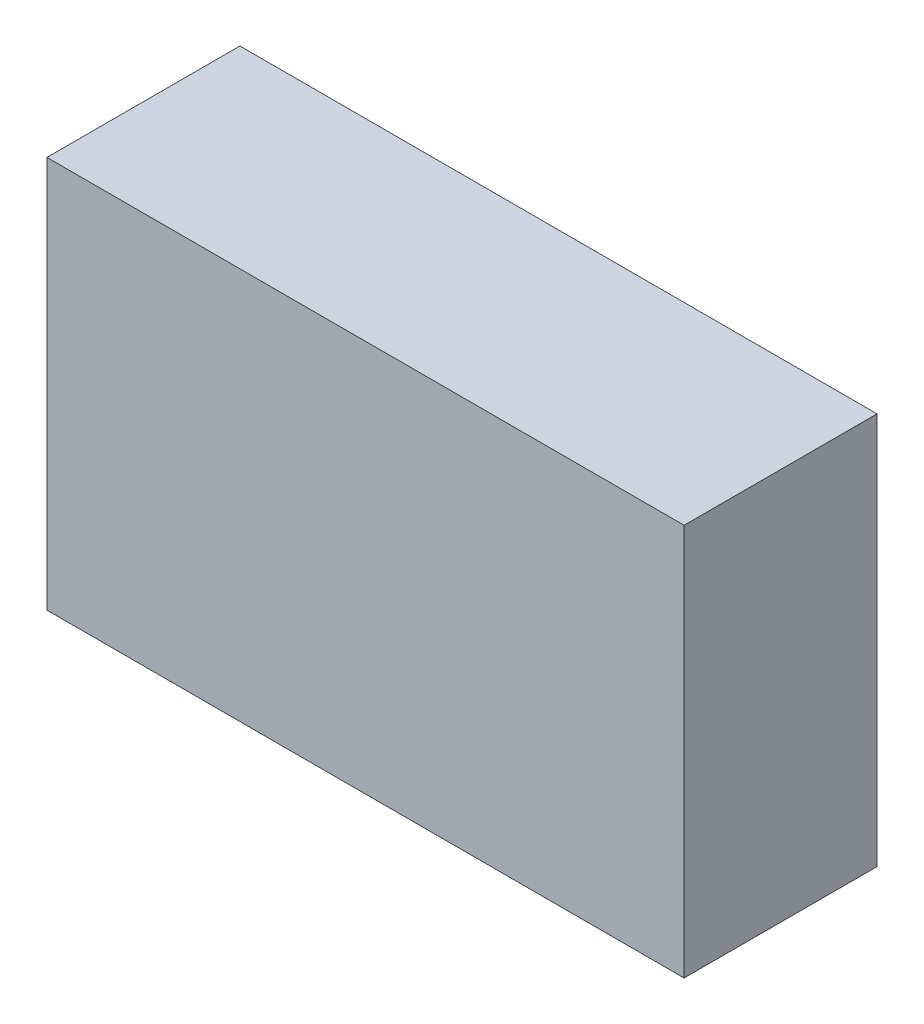
ISO-10303-21;
HEADER;
FILE_DESCRIPTION(('STEP AP214'),'2;1');
FILE_NAME('part.step','',(''),(''),'','','');
FILE_SCHEMA(('AUTOMOTIVE_DESIGN { 1 0 10303 214 1 1 1 1 }'));
ENDSEC;
DATA;
#1=APPLICATION_CONTEXT('core data for automotive mechanical design processes');
#2=APPLICATION_PROTOCOL_DEFINITION('international standard','automotive_design',2000,#1);
#3=PRODUCT_CONTEXT('',#1,'mechanical');
#4=PRODUCT('Part','Part','',(#3));
#5=PRODUCT_RELATED_PRODUCT_CATEGORY('part','',(#4));
#6=PRODUCT_DEFINITION_FORMATION('','',#4);
#7=PRODUCT_DEFINITION_CONTEXT('part definition',#1,'design');
#8=PRODUCT_DEFINITION('design','',#6,#7);
#9=PRODUCT_DEFINITION_SHAPE('','',#8);
#10=(LENGTH_UNIT() NAMED_UNIT(*) SI_UNIT(.MILLI.,.METRE.));
#11=(NAMED_UNIT(*) PLANE_ANGLE_UNIT() SI_UNIT($,.RADIAN.));
#12=(NAMED_UNIT(*) SI_UNIT($,.STERADIAN.) SOLID_ANGLE_UNIT());
#13=UNCERTAINTY_MEASURE_WITH_UNIT(LENGTH_MEASURE(1.E-05),#10,'distance_accuracy_value','');
#14=(GEOMETRIC_REPRESENTATION_CONTEXT(3) GLOBAL_UNCERTAINTY_ASSIGNED_CONTEXT((#13)) GLOBAL_UNIT_ASSIGNED_CONTEXT((#10,
#11,#12)) REPRESENTATION_CONTEXT('',''));
#15=CARTESIAN_POINT('',(0.,0.,0.));
#16=DIRECTION('',(0.,0.,1.));
#17=DIRECTION('',(1.,0.,0.));
#18=AXIS2_PLACEMENT_3D('',#15,#16,#17);
#19=CARTESIAN_POINT('',(-1.778,-1.016,1.));
#20=DIRECTION('',(1.,0.,0.));
#21=DIRECTION('',(0.,0.,-1.));
#22=AXIS2_PLACEMENT_3D('',#19,#20,#21);
#23=PLANE('',#22);
#24=DIRECTION('',(0.,-1.,0.));
#25=VECTOR('',#24,1.);
#26=CARTESIAN_POINT('',(-1.778,-1.016,0.));
#27=LINE('',#26,#25);
#28=CARTESIAN_POINT('',(-1.778,1.016,0.));
#29=VERTEX_POINT('',#28);
#30=CARTESIAN_POINT('',(-1.778,-1.016,0.));
#31=VERTEX_POINT('',#30);
#32=EDGE_CURVE('E95',#29,#31,#27,.T.);
#33=ORIENTED_EDGE('',*,*,#32,.T.);
#34=DIRECTION('',(0.,0.,-1.));
#35=VECTOR('',#34,1.);
#36=CARTESIAN_POINT('',(-1.778,-1.016,1.));
#37=LINE('',#36,#35);
#38=CARTESIAN_POINT('',(-1.778,-1.016,1.));
#39=VERTEX_POINT('',#38);
#40=EDGE_CURVE('E11',#39,#31,#37,.T.);
#41=ORIENTED_EDGE('',*,*,#40,.F.);
#42=DIRECTION('',(0.,-1.,0.));
#43=VECTOR('',#42,1.);
#44=CARTESIAN_POINT('',(-1.778,-1.016,1.));
#45=LINE('',#44,#43);
#46=CARTESIAN_POINT('',(-1.778,1.016,1.));
#47=VERTEX_POINT('',#46);
#48=EDGE_CURVE('E83',#47,#39,#45,.T.);
#49=ORIENTED_EDGE('',*,*,#48,.F.);
#50=DIRECTION('',(0.,0.,-1.));
#51=VECTOR('',#50,1.);
#52=CARTESIAN_POINT('',(-1.778,1.016,1.));
#53=LINE('',#52,#51);
#54=EDGE_CURVE('E91',#47,#29,#53,.T.);
#55=ORIENTED_EDGE('',*,*,#54,.T.);
#56=EDGE_LOOP('',(#33,#41,#49,#55));
#57=FACE_BOUND('',#56,.T.);
#58=ADVANCED_FACE('F32',(#57),#23,.F.);
#59=CARTESIAN_POINT('',(1.524,-1.016,1.));
#60=DIRECTION('',(0.,1.,0.));
#61=DIRECTION('',(0.,0.,1.));
#62=AXIS2_PLACEMENT_3D('',#59,#60,#61);
#63=PLANE('',#62);
#64=DIRECTION('',(1.,0.,0.));
#65=VECTOR('',#64,1.);
#66=CARTESIAN_POINT('',(1.524,-1.016,0.));
#67=LINE('',#66,#65);
#68=CARTESIAN_POINT('',(1.524,-1.016,0.));
#69=VERTEX_POINT('',#68);
#70=EDGE_CURVE('E87',#31,#69,#67,.T.);
#71=ORIENTED_EDGE('',*,*,#70,.T.);
#72=DIRECTION('',(0.,0.,-1.));
#73=VECTOR('',#72,1.);
#74=CARTESIAN_POINT('',(1.524,-1.016,1.));
#75=LINE('',#74,#73);
#76=CARTESIAN_POINT('',(1.524,-1.016,1.));
#77=VERTEX_POINT('',#76);
#78=EDGE_CURVE('E40',#77,#69,#75,.T.);
#79=ORIENTED_EDGE('',*,*,#78,.F.);
#80=DIRECTION('',(1.,0.,0.));
#81=VECTOR('',#80,1.);
#82=CARTESIAN_POINT('',(1.524,-1.016,1.));
#83=LINE('',#82,#81);
#84=EDGE_CURVE('E78',#39,#77,#83,.T.);
#85=ORIENTED_EDGE('',*,*,#84,.F.);
#86=ORIENTED_EDGE('',*,*,#40,.T.);
#87=EDGE_LOOP('',(#71,#79,#85,#86));
#88=FACE_BOUND('',#87,.T.);
#89=ADVANCED_FACE('F86',(#88),#63,.F.);
#90=CARTESIAN_POINT('',(1.524,1.016,1.));
#91=DIRECTION('',(-1.,0.,0.));
#92=DIRECTION('',(0.,0.,1.));
#93=AXIS2_PLACEMENT_3D('',#90,#91,#92);
#94=PLANE('',#93);
#95=DIRECTION('',(0.,1.,0.));
#96=VECTOR('',#95,1.);
#97=CARTESIAN_POINT('',(1.524,1.016,0.));
#98=LINE('',#97,#96);
#99=CARTESIAN_POINT('',(1.524,1.016,0.));
#100=VERTEX_POINT('',#99);
#101=EDGE_CURVE('E65',#69,#100,#98,.T.);
#102=ORIENTED_EDGE('',*,*,#101,.T.);
#103=DIRECTION('',(0.,0.,-1.));
#104=VECTOR('',#103,1.);
#105=CARTESIAN_POINT('',(1.524,1.016,1.));
#106=LINE('',#105,#104);
#107=CARTESIAN_POINT('',(1.524,1.016,1.));
#108=VERTEX_POINT('',#107);
#109=EDGE_CURVE('E88',#108,#100,#106,.T.);
#110=ORIENTED_EDGE('',*,*,#109,.F.);
#111=DIRECTION('',(0.,1.,0.));
#112=VECTOR('',#111,1.);
#113=CARTESIAN_POINT('',(1.524,1.016,1.));
#114=LINE('',#113,#112);
#115=EDGE_CURVE('E81',#77,#108,#114,.T.);
#116=ORIENTED_EDGE('',*,*,#115,.F.);
#117=ORIENTED_EDGE('',*,*,#78,.T.);
#118=EDGE_LOOP('',(#102,#110,#116,#117));
#119=FACE_BOUND('',#118,.T.);
#120=ADVANCED_FACE('F89',(#119),#94,.F.);
#121=CARTESIAN_POINT('',(-1.778,1.016,1.));
#122=DIRECTION('',(0.,-1.,0.));
#123=DIRECTION('',(0.,0.,-1.));
#124=AXIS2_PLACEMENT_3D('',#121,#122,#123);
#125=PLANE('',#124);
#126=DIRECTION('',(-1.,0.,0.));
#127=VECTOR('',#126,1.);
#128=CARTESIAN_POINT('',(-1.778,1.016,0.));
#129=LINE('',#128,#127);
#130=EDGE_CURVE('E71',#100,#29,#129,.T.);
#131=ORIENTED_EDGE('',*,*,#130,.T.);
#132=ORIENTED_EDGE('',*,*,#54,.F.);
#133=DIRECTION('',(-1.,0.,0.));
#134=VECTOR('',#133,1.);
#135=CARTESIAN_POINT('',(-1.778,1.016,1.));
#136=LINE('',#135,#134);
#137=EDGE_CURVE('E48',#108,#47,#136,.T.);
#138=ORIENTED_EDGE('',*,*,#137,.F.);
#139=ORIENTED_EDGE('',*,*,#109,.T.);
#140=EDGE_LOOP('',(#131,#132,#138,#139));
#141=FACE_BOUND('',#140,.T.);
#142=ADVANCED_FACE('F102',(#141),#125,.F.);
#143=CARTESIAN_POINT('',(0.,0.,1.));
#144=DIRECTION('',(0.,0.,-1.));
#145=DIRECTION('',(-1.,0.,0.));
#146=AXIS2_PLACEMENT_3D('',#143,#144,#145);
#147=PLANE('',#146);
#148=ORIENTED_EDGE('',*,*,#48,.T.);
#149=ORIENTED_EDGE('',*,*,#84,.T.);
#150=ORIENTED_EDGE('',*,*,#115,.T.);
#151=ORIENTED_EDGE('',*,*,#137,.T.);
#152=EDGE_LOOP('',(#148,#149,#150,#151));
#153=FACE_BOUND('',#152,.T.);
#154=ADVANCED_FACE('F79',(#153),#147,.F.);
#155=CARTESIAN_POINT('',(0.,0.,0.));
#156=DIRECTION('',(0.,0.,-1.));
#157=DIRECTION('',(-1.,0.,0.));
#158=AXIS2_PLACEMENT_3D('',#155,#156,#157);
#159=PLANE('',#158);
#160=ORIENTED_EDGE('',*,*,#32,.F.);
#161=ORIENTED_EDGE('',*,*,#130,.F.);
#162=ORIENTED_EDGE('',*,*,#101,.F.);
#163=ORIENTED_EDGE('',*,*,#70,.F.);
#164=EDGE_LOOP('',(#160,#161,#162,#163));
#165=FACE_BOUND('',#164,.T.);
#166=ADVANCED_FACE('F105',(#165),#159,.T.);
#167=CLOSED_SHELL('',(#58,#89,#120,#142,#154,#166));
#168=MANIFOLD_SOLID_BREP('B2',#167);
#169=ADVANCED_BREP_SHAPE_REPRESENTATION('',(#18,#168),#14);
#170=SHAPE_DEFINITION_REPRESENTATION(#9,#169);
ENDSEC;
END-ISO-10303-21;
